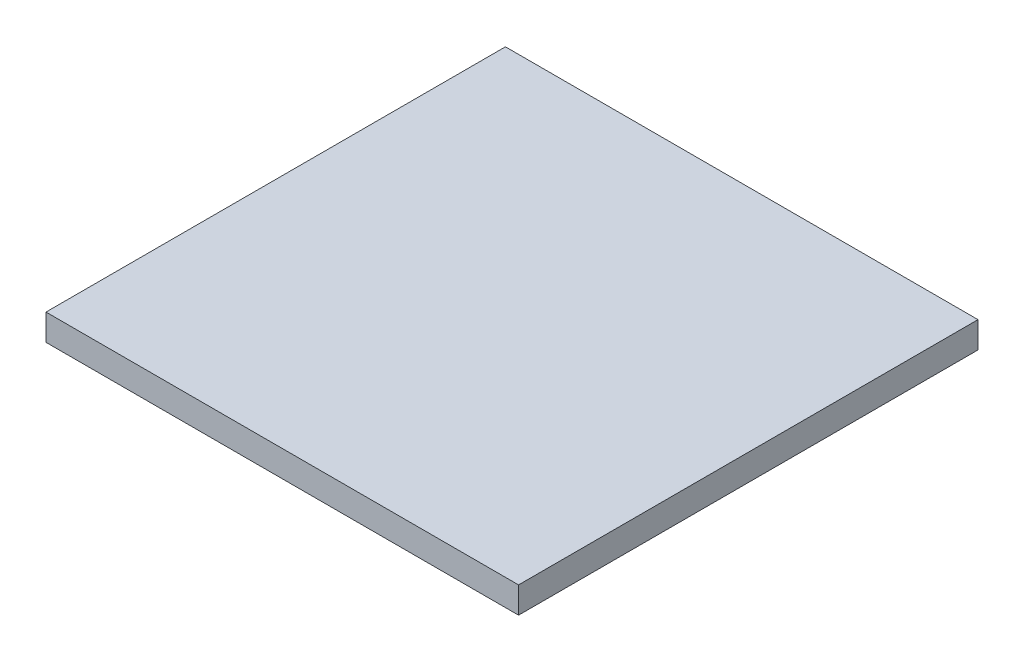
ISO-10303-21;
HEADER;
FILE_DESCRIPTION(('STEP AP214'),'2;1');
FILE_NAME('part.step','',(''),(''),'','','');
FILE_SCHEMA(('AUTOMOTIVE_DESIGN { 1 0 10303 214 1 1 1 1 }'));
ENDSEC;
DATA;
#1=APPLICATION_CONTEXT('core data for automotive mechanical design processes');
#2=APPLICATION_PROTOCOL_DEFINITION('international standard','automotive_design',2000,#1);
#3=PRODUCT_CONTEXT('',#1,'mechanical');
#4=PRODUCT('Part','Part','',(#3));
#5=PRODUCT_RELATED_PRODUCT_CATEGORY('part','',(#4));
#6=PRODUCT_DEFINITION_FORMATION('','',#4);
#7=PRODUCT_DEFINITION_CONTEXT('part definition',#1,'design');
#8=PRODUCT_DEFINITION('design','',#6,#7);
#9=PRODUCT_DEFINITION_SHAPE('','',#8);
#10=(LENGTH_UNIT() NAMED_UNIT(*) SI_UNIT(.MILLI.,.METRE.));
#11=(NAMED_UNIT(*) PLANE_ANGLE_UNIT() SI_UNIT($,.RADIAN.));
#12=(NAMED_UNIT(*) SI_UNIT($,.STERADIAN.) SOLID_ANGLE_UNIT());
#13=UNCERTAINTY_MEASURE_WITH_UNIT(LENGTH_MEASURE(1.E-05),#10,'distance_accuracy_value','');
#14=(GEOMETRIC_REPRESENTATION_CONTEXT(3) GLOBAL_UNCERTAINTY_ASSIGNED_CONTEXT((#13)) GLOBAL_UNIT_ASSIGNED_CONTEXT((#10,
#11,#12)) REPRESENTATION_CONTEXT('',''));
#15=CARTESIAN_POINT('',(0.,0.,0.));
#16=DIRECTION('',(0.,0.,1.));
#17=DIRECTION('',(1.,0.,0.));
#18=AXIS2_PLACEMENT_3D('',#15,#16,#17);
#19=CARTESIAN_POINT('',(0.,2.,0.));
#20=DIRECTION('',(1.,0.,0.));
#21=DIRECTION('',(0.,0.,-1.));
#22=AXIS2_PLACEMENT_3D('',#19,#20,#21);
#23=PLANE('',#22);
#24=DIRECTION('',(0.,0.,1.));
#25=VECTOR('',#24,1.);
#26=CARTESIAN_POINT('',(0.,0.,0.));
#27=LINE('',#26,#25);
#28=CARTESIAN_POINT('',(0.,0.,0.));
#29=VERTEX_POINT('',#28);
#30=CARTESIAN_POINT('',(0.,0.,35.));
#31=VERTEX_POINT('',#30);
#32=EDGE_CURVE('E107',#29,#31,#27,.T.);
#33=ORIENTED_EDGE('',*,*,#32,.T.);
#34=DIRECTION('',(0.,-1.,0.));
#35=VECTOR('',#34,1.);
#36=CARTESIAN_POINT('',(0.,2.,35.));
#37=LINE('',#36,#35);
#38=CARTESIAN_POINT('',(0.,2.,35.));
#39=VERTEX_POINT('',#38);
#40=EDGE_CURVE('E11',#39,#31,#37,.T.);
#41=ORIENTED_EDGE('',*,*,#40,.F.);
#42=DIRECTION('',(0.,0.,1.));
#43=VECTOR('',#42,1.);
#44=CARTESIAN_POINT('',(0.,2.,0.));
#45=LINE('',#44,#43);
#46=CARTESIAN_POINT('',(0.,2.,0.));
#47=VERTEX_POINT('',#46);
#48=EDGE_CURVE('E91',#47,#39,#45,.T.);
#49=ORIENTED_EDGE('',*,*,#48,.F.);
#50=DIRECTION('',(0.,-1.,0.));
#51=VECTOR('',#50,1.);
#52=CARTESIAN_POINT('',(0.,2.,0.));
#53=LINE('',#52,#51);
#54=EDGE_CURVE('E103',#47,#29,#53,.T.);
#55=ORIENTED_EDGE('',*,*,#54,.T.);
#56=EDGE_LOOP('',(#33,#41,#49,#55));
#57=FACE_BOUND('',#56,.T.);
#58=ADVANCED_FACE('F39',(#57),#23,.F.);
#59=CARTESIAN_POINT('',(0.,2.,35.));
#60=DIRECTION('',(0.,0.,-1.));
#61=DIRECTION('',(-1.,0.,0.));
#62=AXIS2_PLACEMENT_3D('',#59,#60,#61);
#63=PLANE('',#62);
#64=DIRECTION('',(1.,0.,0.));
#65=VECTOR('',#64,1.);
#66=CARTESIAN_POINT('',(0.,0.,35.));
#67=LINE('',#66,#65);
#68=CARTESIAN_POINT('',(36.,0.,35.));
#69=VERTEX_POINT('',#68);
#70=EDGE_CURVE('E96',#31,#69,#67,.T.);
#71=ORIENTED_EDGE('',*,*,#70,.T.);
#72=DIRECTION('',(0.,-1.,0.));
#73=VECTOR('',#72,1.);
#74=CARTESIAN_POINT('',(36.,2.,35.));
#75=LINE('',#74,#73);
#76=CARTESIAN_POINT('',(36.,2.,35.));
#77=VERTEX_POINT('',#76);
#78=EDGE_CURVE('E48',#77,#69,#75,.T.);
#79=ORIENTED_EDGE('',*,*,#78,.F.);
#80=DIRECTION('',(1.,0.,0.));
#81=VECTOR('',#80,1.);
#82=CARTESIAN_POINT('',(0.,2.,35.));
#83=LINE('',#82,#81);
#84=EDGE_CURVE('E86',#39,#77,#83,.T.);
#85=ORIENTED_EDGE('',*,*,#84,.F.);
#86=ORIENTED_EDGE('',*,*,#40,.T.);
#87=EDGE_LOOP('',(#71,#79,#85,#86));
#88=FACE_BOUND('',#87,.T.);
#89=ADVANCED_FACE('F95',(#88),#63,.F.);
#90=CARTESIAN_POINT('',(36.,2.,0.));
#91=DIRECTION('',(-1.,0.,0.));
#92=DIRECTION('',(0.,0.,1.));
#93=AXIS2_PLACEMENT_3D('',#90,#91,#92);
#94=PLANE('',#93);
#95=DIRECTION('',(0.,0.,-1.));
#96=VECTOR('',#95,1.);
#97=CARTESIAN_POINT('',(36.,0.,0.));
#98=LINE('',#97,#96);
#99=CARTESIAN_POINT('',(36.,0.,0.));
#100=VERTEX_POINT('',#99);
#101=EDGE_CURVE('E73',#69,#100,#98,.T.);
#102=ORIENTED_EDGE('',*,*,#101,.T.);
#103=DIRECTION('',(0.,-1.,0.));
#104=VECTOR('',#103,1.);
#105=CARTESIAN_POINT('',(36.,2.,0.));
#106=LINE('',#105,#104);
#107=CARTESIAN_POINT('',(36.,2.,0.));
#108=VERTEX_POINT('',#107);
#109=EDGE_CURVE('E98',#108,#100,#106,.T.);
#110=ORIENTED_EDGE('',*,*,#109,.F.);
#111=DIRECTION('',(0.,0.,-1.));
#112=VECTOR('',#111,1.);
#113=CARTESIAN_POINT('',(36.,2.,0.));
#114=LINE('',#113,#112);
#115=EDGE_CURVE('E89',#77,#108,#114,.T.);
#116=ORIENTED_EDGE('',*,*,#115,.F.);
#117=ORIENTED_EDGE('',*,*,#78,.T.);
#118=EDGE_LOOP('',(#102,#110,#116,#117));
#119=FACE_BOUND('',#118,.T.);
#120=ADVANCED_FACE('F99',(#119),#94,.F.);
#121=CARTESIAN_POINT('',(0.,2.,0.));
#122=DIRECTION('',(0.,0.,1.));
#123=DIRECTION('',(1.,0.,0.));
#124=AXIS2_PLACEMENT_3D('',#121,#122,#123);
#125=PLANE('',#124);
#126=DIRECTION('',(-1.,0.,0.));
#127=VECTOR('',#126,1.);
#128=CARTESIAN_POINT('',(0.,0.,0.));
#129=LINE('',#128,#127);
#130=EDGE_CURVE('E79',#100,#29,#129,.T.);
#131=ORIENTED_EDGE('',*,*,#130,.T.);
#132=ORIENTED_EDGE('',*,*,#54,.F.);
#133=DIRECTION('',(-1.,0.,0.));
#134=VECTOR('',#133,1.);
#135=CARTESIAN_POINT('',(0.,2.,0.));
#136=LINE('',#135,#134);
#137=EDGE_CURVE('E56',#108,#47,#136,.T.);
#138=ORIENTED_EDGE('',*,*,#137,.F.);
#139=ORIENTED_EDGE('',*,*,#109,.T.);
#140=EDGE_LOOP('',(#131,#132,#138,#139));
#141=FACE_BOUND('',#140,.T.);
#142=ADVANCED_FACE('F120',(#141),#125,.F.);
#143=CARTESIAN_POINT('',(0.,2.,0.));
#144=DIRECTION('',(0.,1.,0.));
#145=DIRECTION('',(0.,0.,1.));
#146=AXIS2_PLACEMENT_3D('',#143,#144,#145);
#147=PLANE('',#146);
#148=ORIENTED_EDGE('',*,*,#48,.T.);
#149=ORIENTED_EDGE('',*,*,#84,.T.);
#150=ORIENTED_EDGE('',*,*,#115,.T.);
#151=ORIENTED_EDGE('',*,*,#137,.T.);
#152=EDGE_LOOP('',(#148,#149,#150,#151));
#153=FACE_BOUND('',#152,.T.);
#154=ADVANCED_FACE('F87',(#153),#147,.T.);
#155=CARTESIAN_POINT('',(0.,0.,0.));
#156=DIRECTION('',(0.,1.,0.));
#157=DIRECTION('',(0.,0.,1.));
#158=AXIS2_PLACEMENT_3D('',#155,#156,#157);
#159=PLANE('',#158);
#160=ORIENTED_EDGE('',*,*,#32,.F.);
#161=ORIENTED_EDGE('',*,*,#130,.F.);
#162=ORIENTED_EDGE('',*,*,#101,.F.);
#163=ORIENTED_EDGE('',*,*,#70,.F.);
#164=EDGE_LOOP('',(#160,#161,#162,#163));
#165=FACE_BOUND('',#164,.T.);
#166=ADVANCED_FACE('F123',(#165),#159,.F.);
#167=CLOSED_SHELL('',(#58,#89,#120,#142,#154,#166));
#168=MANIFOLD_SOLID_BREP('B2',#167);
#169=ADVANCED_BREP_SHAPE_REPRESENTATION('',(#18,#168),#14);
#170=SHAPE_DEFINITION_REPRESENTATION(#9,#169);
ENDSEC;
END-ISO-10303-21;
